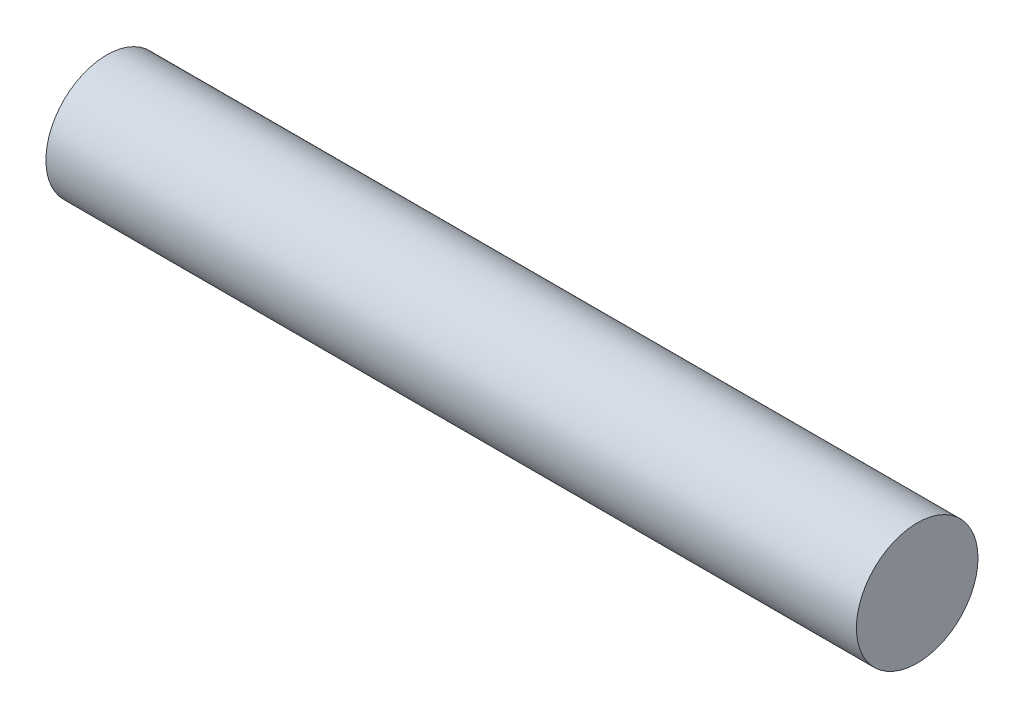
ISO-10303-21;
HEADER;
FILE_DESCRIPTION(('STEP AP214'),'2;1');
FILE_NAME('part.step','',(''),(''),'','','');
FILE_SCHEMA(('AUTOMOTIVE_DESIGN { 1 0 10303 214 1 1 1 1 }'));
ENDSEC;
DATA;
#1=APPLICATION_CONTEXT('core data for automotive mechanical design processes');
#2=APPLICATION_PROTOCOL_DEFINITION('international standard','automotive_design',2000,#1);
#3=PRODUCT_CONTEXT('',#1,'mechanical');
#4=PRODUCT('Part','Part','',(#3));
#5=PRODUCT_RELATED_PRODUCT_CATEGORY('part','',(#4));
#6=PRODUCT_DEFINITION_FORMATION('','',#4);
#7=PRODUCT_DEFINITION_CONTEXT('part definition',#1,'design');
#8=PRODUCT_DEFINITION('design','',#6,#7);
#9=PRODUCT_DEFINITION_SHAPE('','',#8);
#10=(LENGTH_UNIT() NAMED_UNIT(*) SI_UNIT(.MILLI.,.METRE.));
#11=(NAMED_UNIT(*) PLANE_ANGLE_UNIT() SI_UNIT($,.RADIAN.));
#12=(NAMED_UNIT(*) SI_UNIT($,.STERADIAN.) SOLID_ANGLE_UNIT());
#13=UNCERTAINTY_MEASURE_WITH_UNIT(LENGTH_MEASURE(1.E-05),#10,'distance_accuracy_value','');
#14=(GEOMETRIC_REPRESENTATION_CONTEXT(3) GLOBAL_UNCERTAINTY_ASSIGNED_CONTEXT((#13)) GLOBAL_UNIT_ASSIGNED_CONTEXT((#10,
#11,#12)) REPRESENTATION_CONTEXT('',''));
#15=CARTESIAN_POINT('',(0.,0.,0.));
#16=DIRECTION('',(0.,0.,1.));
#17=DIRECTION('',(1.,0.,0.));
#18=AXIS2_PLACEMENT_3D('',#15,#16,#17);
#19=CARTESIAN_POINT('',(10.,0.,0.));
#20=DIRECTION('',(-1.,0.,0.));
#21=DIRECTION('',(0.,0.,1.));
#22=AXIS2_PLACEMENT_3D('',#19,#20,#21);
#23=CYLINDRICAL_SURFACE('',#22,0.750000000000001);
#24=CARTESIAN_POINT('',(10.,0.,0.));
#25=DIRECTION('',(1.,0.,0.));
#26=DIRECTION('',(0.,0.,-1.));
#27=AXIS2_PLACEMENT_3D('',#24,#25,#26);
#28=CIRCLE('',#27,0.750000000000001);
#29=CARTESIAN_POINT('',(10.,0.,-0.750000000000001));
#30=VERTEX_POINT('',#29);
#31=EDGE_CURVE('E10',#30,#30,#28,.T.);
#32=ORIENTED_EDGE('',*,*,#31,.F.);
#33=EDGE_LOOP('',(#32));
#34=FACE_BOUND('',#33,.T.);
#35=CARTESIAN_POINT('',(0.,0.,0.));
#36=DIRECTION('',(1.,0.,0.));
#37=DIRECTION('',(0.,0.,-1.));
#38=AXIS2_PLACEMENT_3D('',#35,#36,#37);
#39=CIRCLE('',#38,0.750000000000001);
#40=CARTESIAN_POINT('',(0.,0.,-0.750000000000001));
#41=VERTEX_POINT('',#40);
#42=EDGE_CURVE('E35',#41,#41,#39,.T.);
#43=ORIENTED_EDGE('',*,*,#42,.T.);
#44=EDGE_LOOP('',(#43));
#45=FACE_BOUND('',#44,.T.);
#46=ADVANCED_FACE('F32',(#34,#45),#23,.T.);
#47=CARTESIAN_POINT('',(10.,0.,0.));
#48=DIRECTION('',(1.,0.,0.));
#49=DIRECTION('',(0.,0.,-1.));
#50=AXIS2_PLACEMENT_3D('',#47,#48,#49);
#51=PLANE('',#50);
#52=ORIENTED_EDGE('',*,*,#31,.T.);
#53=EDGE_LOOP('',(#52));
#54=FACE_BOUND('',#53,.T.);
#55=ADVANCED_FACE('F47',(#54),#51,.T.);
#56=CARTESIAN_POINT('',(0.,0.,0.));
#57=DIRECTION('',(1.,0.,0.));
#58=DIRECTION('',(0.,0.,-1.));
#59=AXIS2_PLACEMENT_3D('',#56,#57,#58);
#60=PLANE('',#59);
#61=ORIENTED_EDGE('',*,*,#42,.F.);
#62=EDGE_LOOP('',(#61));
#63=FACE_BOUND('',#62,.T.);
#64=ADVANCED_FACE('F45',(#63),#60,.F.);
#65=CLOSED_SHELL('',(#46,#55,#64));
#66=MANIFOLD_SOLID_BREP('B2',#65);
#67=ADVANCED_BREP_SHAPE_REPRESENTATION('',(#18,#66),#14);
#68=SHAPE_DEFINITION_REPRESENTATION(#9,#67);
ENDSEC;
END-ISO-10303-21;
